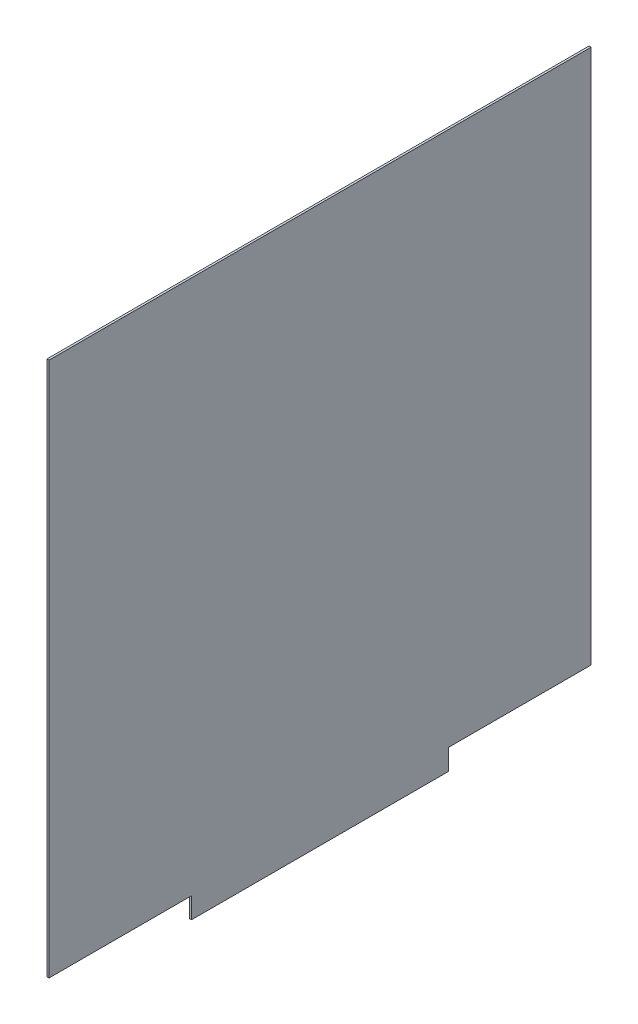
ISO-10303-21;
HEADER;
FILE_DESCRIPTION(('STEP AP214'),'2;1');
FILE_NAME('part.step','',(''),(''),'','','');
FILE_SCHEMA(('AUTOMOTIVE_DESIGN { 1 0 10303 214 1 1 1 1 }'));
ENDSEC;
DATA;
#1=APPLICATION_CONTEXT('core data for automotive mechanical design processes');
#2=APPLICATION_PROTOCOL_DEFINITION('international standard','automotive_design',2000,#1);
#3=PRODUCT_CONTEXT('',#1,'mechanical');
#4=PRODUCT('Part','Part','',(#3));
#5=PRODUCT_RELATED_PRODUCT_CATEGORY('part','',(#4));
#6=PRODUCT_DEFINITION_FORMATION('','',#4);
#7=PRODUCT_DEFINITION_CONTEXT('part definition',#1,'design');
#8=PRODUCT_DEFINITION('design','',#6,#7);
#9=PRODUCT_DEFINITION_SHAPE('','',#8);
#10=(LENGTH_UNIT() NAMED_UNIT(*) SI_UNIT(.MILLI.,.METRE.));
#11=(NAMED_UNIT(*) PLANE_ANGLE_UNIT() SI_UNIT($,.RADIAN.));
#12=(NAMED_UNIT(*) SI_UNIT($,.STERADIAN.) SOLID_ANGLE_UNIT());
#13=UNCERTAINTY_MEASURE_WITH_UNIT(LENGTH_MEASURE(1.E-05),#10,'distance_accuracy_value','');
#14=(GEOMETRIC_REPRESENTATION_CONTEXT(3) GLOBAL_UNCERTAINTY_ASSIGNED_CONTEXT((#13)) GLOBAL_UNIT_ASSIGNED_CONTEXT((#10,
#11,#12)) REPRESENTATION_CONTEXT('',''));
#15=CARTESIAN_POINT('',(0.,0.,0.));
#16=DIRECTION('',(0.,0.,1.));
#17=DIRECTION('',(1.,0.,0.));
#18=AXIS2_PLACEMENT_3D('',#15,#16,#17);
#19=CARTESIAN_POINT('',(678.,400.,-3.));
#20=DIRECTION('',(0.,0.,-1.));
#21=DIRECTION('',(0.,1.,0.));
#22=AXIS2_PLACEMENT_3D('',#19,#20,#21);
#23=PLANE('',#22);
#24=DIRECTION('',(0.,-1.,0.));
#25=VECTOR('',#24,1.);
#26=CARTESIAN_POINT('',(675.,400.,-3.));
#27=LINE('',#26,#25);
#28=CARTESIAN_POINT('',(675.,400.,-3.));
#29=VERTEX_POINT('',#28);
#30=CARTESIAN_POINT('',(675.,-370.,-3.));
#31=VERTEX_POINT('',#30);
#32=EDGE_CURVE('E194',#29,#31,#27,.T.);
#33=ORIENTED_EDGE('',*,*,#32,.T.);
#34=DIRECTION('',(-1.,0.,0.));
#35=VECTOR('',#34,1.);
#36=CARTESIAN_POINT('',(678.,-370.,-3.));
#37=LINE('',#36,#35);
#38=CARTESIAN_POINT('',(678.,-370.,-3.));
#39=VERTEX_POINT('',#38);
#40=EDGE_CURVE('E12',#39,#31,#37,.T.);
#41=ORIENTED_EDGE('',*,*,#40,.F.);
#42=DIRECTION('',(0.,-1.,0.));
#43=VECTOR('',#42,1.);
#44=CARTESIAN_POINT('',(678.,400.,-3.));
#45=LINE('',#44,#43);
#46=CARTESIAN_POINT('',(678.,400.,-3.));
#47=VERTEX_POINT('',#46);
#48=EDGE_CURVE('E159',#47,#39,#45,.T.);
#49=ORIENTED_EDGE('',*,*,#48,.F.);
#50=DIRECTION('',(-1.,0.,0.));
#51=VECTOR('',#50,1.);
#52=CARTESIAN_POINT('',(678.,400.,-3.));
#53=LINE('',#52,#51);
#54=EDGE_CURVE('E134',#47,#29,#53,.T.);
#55=ORIENTED_EDGE('',*,*,#54,.T.);
#56=EDGE_LOOP('',(#33,#41,#49,#55));
#57=FACE_BOUND('',#56,.T.);
#58=ADVANCED_FACE('F39',(#57),#23,.F.);
#59=CARTESIAN_POINT('',(678.,-370.,-3.));
#60=DIRECTION('',(0.,1.,0.));
#61=DIRECTION('',(0.,0.,1.));
#62=AXIS2_PLACEMENT_3D('',#59,#60,#61);
#63=PLANE('',#62);
#64=DIRECTION('',(0.,0.,-1.));
#65=VECTOR('',#64,1.);
#66=CARTESIAN_POINT('',(675.,-370.,-3.));
#67=LINE('',#66,#65);
#68=CARTESIAN_POINT('',(675.,-370.,-208.));
#69=VERTEX_POINT('',#68);
#70=EDGE_CURVE('E188',#31,#69,#67,.T.);
#71=ORIENTED_EDGE('',*,*,#70,.T.);
#72=DIRECTION('',(-1.,0.,0.));
#73=VECTOR('',#72,1.);
#74=CARTESIAN_POINT('',(678.,-370.,-208.));
#75=LINE('',#74,#73);
#76=CARTESIAN_POINT('',(678.,-370.,-208.));
#77=VERTEX_POINT('',#76);
#78=EDGE_CURVE('E47',#77,#69,#75,.T.);
#79=ORIENTED_EDGE('',*,*,#78,.F.);
#80=DIRECTION('',(0.,0.,-1.));
#81=VECTOR('',#80,1.);
#82=CARTESIAN_POINT('',(678.,-370.,-3.));
#83=LINE('',#82,#81);
#84=EDGE_CURVE('E98',#39,#77,#83,.T.);
#85=ORIENTED_EDGE('',*,*,#84,.F.);
#86=ORIENTED_EDGE('',*,*,#40,.T.);
#87=EDGE_LOOP('',(#71,#79,#85,#86));
#88=FACE_BOUND('',#87,.T.);
#89=ADVANCED_FACE('F213',(#88),#63,.F.);
#90=CARTESIAN_POINT('',(678.,-370.,-208.));
#91=DIRECTION('',(0.,0.,-1.));
#92=DIRECTION('',(-1.,0.,0.));
#93=AXIS2_PLACEMENT_3D('',#90,#91,#92);
#94=PLANE('',#93);
#95=DIRECTION('',(0.,-1.,0.));
#96=VECTOR('',#95,1.);
#97=CARTESIAN_POINT('',(675.,-370.,-208.));
#98=LINE('',#97,#96);
#99=CARTESIAN_POINT('',(675.,-400.,-208.));
#100=VERTEX_POINT('',#99);
#101=EDGE_CURVE('E183',#69,#100,#98,.T.);
#102=ORIENTED_EDGE('',*,*,#101,.T.);
#103=DIRECTION('',(-1.,0.,0.));
#104=VECTOR('',#103,1.);
#105=CARTESIAN_POINT('',(678.,-400.,-208.));
#106=LINE('',#105,#104);
#107=CARTESIAN_POINT('',(678.,-400.,-208.));
#108=VERTEX_POINT('',#107);
#109=EDGE_CURVE('E175',#108,#100,#106,.T.);
#110=ORIENTED_EDGE('',*,*,#109,.F.);
#111=DIRECTION('',(0.,-1.,0.));
#112=VECTOR('',#111,1.);
#113=CARTESIAN_POINT('',(678.,-370.,-208.));
#114=LINE('',#113,#112);
#115=EDGE_CURVE('E151',#77,#108,#114,.T.);
#116=ORIENTED_EDGE('',*,*,#115,.F.);
#117=ORIENTED_EDGE('',*,*,#78,.T.);
#118=EDGE_LOOP('',(#102,#110,#116,#117));
#119=FACE_BOUND('',#118,.T.);
#120=ADVANCED_FACE('F181',(#119),#94,.F.);
#121=CARTESIAN_POINT('',(678.,-400.,-208.));
#122=DIRECTION('',(0.,1.,0.));
#123=DIRECTION('',(0.,0.,1.));
#124=AXIS2_PLACEMENT_3D('',#121,#122,#123);
#125=PLANE('',#124);
#126=DIRECTION('',(0.,0.,-1.));
#127=VECTOR('',#126,1.);
#128=CARTESIAN_POINT('',(675.,-400.,-208.));
#129=LINE('',#128,#127);
#130=CARTESIAN_POINT('',(675.,-400.,-578.));
#131=VERTEX_POINT('',#130);
#132=EDGE_CURVE('E190',#100,#131,#129,.T.);
#133=ORIENTED_EDGE('',*,*,#132,.T.);
#134=DIRECTION('',(-1.,0.,0.));
#135=VECTOR('',#134,1.);
#136=CARTESIAN_POINT('',(678.,-400.,-578.));
#137=LINE('',#136,#135);
#138=CARTESIAN_POINT('',(678.,-400.,-578.));
#139=VERTEX_POINT('',#138);
#140=EDGE_CURVE('E172',#139,#131,#137,.T.);
#141=ORIENTED_EDGE('',*,*,#140,.F.);
#142=DIRECTION('',(0.,0.,-1.));
#143=VECTOR('',#142,1.);
#144=CARTESIAN_POINT('',(678.,-400.,-208.));
#145=LINE('',#144,#143);
#146=EDGE_CURVE('E147',#108,#139,#145,.T.);
#147=ORIENTED_EDGE('',*,*,#146,.F.);
#148=ORIENTED_EDGE('',*,*,#109,.T.);
#149=EDGE_LOOP('',(#133,#141,#147,#148));
#150=FACE_BOUND('',#149,.T.);
#151=ADVANCED_FACE('F220',(#150),#125,.F.);
#152=CARTESIAN_POINT('',(678.,-400.,-578.));
#153=DIRECTION('',(0.,0.,1.));
#154=DIRECTION('',(1.,0.,0.));
#155=AXIS2_PLACEMENT_3D('',#152,#153,#154);
#156=PLANE('',#155);
#157=DIRECTION('',(0.,1.,0.));
#158=VECTOR('',#157,1.);
#159=CARTESIAN_POINT('',(675.,-400.,-578.));
#160=LINE('',#159,#158);
#161=CARTESIAN_POINT('',(675.,-370.,-578.));
#162=VERTEX_POINT('',#161);
#163=EDGE_CURVE('E192',#131,#162,#160,.T.);
#164=ORIENTED_EDGE('',*,*,#163,.T.);
#165=DIRECTION('',(-1.,0.,0.));
#166=VECTOR('',#165,1.);
#167=CARTESIAN_POINT('',(678.,-370.,-578.));
#168=LINE('',#167,#166);
#169=CARTESIAN_POINT('',(678.,-370.,-578.));
#170=VERTEX_POINT('',#169);
#171=EDGE_CURVE('E127',#170,#162,#168,.T.);
#172=ORIENTED_EDGE('',*,*,#171,.F.);
#173=DIRECTION('',(0.,1.,0.));
#174=VECTOR('',#173,1.);
#175=CARTESIAN_POINT('',(678.,-400.,-578.));
#176=LINE('',#175,#174);
#177=EDGE_CURVE('E117',#139,#170,#176,.T.);
#178=ORIENTED_EDGE('',*,*,#177,.F.);
#179=ORIENTED_EDGE('',*,*,#140,.T.);
#180=EDGE_LOOP('',(#164,#172,#178,#179));
#181=FACE_BOUND('',#180,.T.);
#182=ADVANCED_FACE('F198',(#181),#156,.F.);
#183=CARTESIAN_POINT('',(678.,-370.,-578.));
#184=DIRECTION('',(0.,1.,0.));
#185=DIRECTION('',(0.,0.,1.));
#186=AXIS2_PLACEMENT_3D('',#183,#184,#185);
#187=PLANE('',#186);
#188=DIRECTION('',(0.,0.,-1.));
#189=VECTOR('',#188,1.);
#190=CARTESIAN_POINT('',(675.,-370.,-578.));
#191=LINE('',#190,#189);
#192=CARTESIAN_POINT('',(675.,-370.,-783.));
#193=VERTEX_POINT('',#192);
#194=EDGE_CURVE('E126',#162,#193,#191,.T.);
#195=ORIENTED_EDGE('',*,*,#194,.T.);
#196=DIRECTION('',(-1.,0.,0.));
#197=VECTOR('',#196,1.);
#198=CARTESIAN_POINT('',(678.,-370.,-783.));
#199=LINE('',#198,#197);
#200=CARTESIAN_POINT('',(678.,-370.,-783.));
#201=VERTEX_POINT('',#200);
#202=EDGE_CURVE('E123',#201,#193,#199,.T.);
#203=ORIENTED_EDGE('',*,*,#202,.F.);
#204=DIRECTION('',(0.,0.,-1.));
#205=VECTOR('',#204,1.);
#206=CARTESIAN_POINT('',(678.,-370.,-578.));
#207=LINE('',#206,#205);
#208=EDGE_CURVE('E111',#170,#201,#207,.T.);
#209=ORIENTED_EDGE('',*,*,#208,.F.);
#210=ORIENTED_EDGE('',*,*,#171,.T.);
#211=EDGE_LOOP('',(#195,#203,#209,#210));
#212=FACE_BOUND('',#211,.T.);
#213=ADVANCED_FACE('F124',(#212),#187,.F.);
#214=CARTESIAN_POINT('',(678.,400.,-783.));
#215=DIRECTION('',(0.,0.,1.));
#216=DIRECTION('',(0.,-1.,0.));
#217=AXIS2_PLACEMENT_3D('',#214,#215,#216);
#218=PLANE('',#217);
#219=DIRECTION('',(0.,1.,0.));
#220=VECTOR('',#219,1.);
#221=CARTESIAN_POINT('',(675.,400.,-783.));
#222=LINE('',#221,#220);
#223=CARTESIAN_POINT('',(675.,400.,-783.));
#224=VERTEX_POINT('',#223);
#225=EDGE_CURVE('E84',#193,#224,#222,.T.);
#226=ORIENTED_EDGE('',*,*,#225,.T.);
#227=DIRECTION('',(-1.,0.,0.));
#228=VECTOR('',#227,1.);
#229=CARTESIAN_POINT('',(678.,400.,-783.));
#230=LINE('',#229,#228);
#231=CARTESIAN_POINT('',(678.,400.,-783.));
#232=VERTEX_POINT('',#231);
#233=EDGE_CURVE('E128',#232,#224,#230,.T.);
#234=ORIENTED_EDGE('',*,*,#233,.F.);
#235=DIRECTION('',(0.,1.,0.));
#236=VECTOR('',#235,1.);
#237=CARTESIAN_POINT('',(678.,400.,-783.));
#238=LINE('',#237,#236);
#239=EDGE_CURVE('E115',#201,#232,#238,.T.);
#240=ORIENTED_EDGE('',*,*,#239,.F.);
#241=ORIENTED_EDGE('',*,*,#202,.T.);
#242=EDGE_LOOP('',(#226,#234,#240,#241));
#243=FACE_BOUND('',#242,.T.);
#244=ADVANCED_FACE('F130',(#243),#218,.F.);
#245=CARTESIAN_POINT('',(678.,400.,-3.));
#246=DIRECTION('',(0.,-1.,0.));
#247=DIRECTION('',(0.,0.,-1.));
#248=AXIS2_PLACEMENT_3D('',#245,#246,#247);
#249=PLANE('',#248);
#250=DIRECTION('',(0.,0.,1.));
#251=VECTOR('',#250,1.);
#252=CARTESIAN_POINT('',(675.,400.,-3.));
#253=LINE('',#252,#251);
#254=EDGE_CURVE('E90',#224,#29,#253,.T.);
#255=ORIENTED_EDGE('',*,*,#254,.T.);
#256=ORIENTED_EDGE('',*,*,#54,.F.);
#257=DIRECTION('',(0.,0.,1.));
#258=VECTOR('',#257,1.);
#259=CARTESIAN_POINT('',(678.,400.,-3.));
#260=LINE('',#259,#258);
#261=EDGE_CURVE('E55',#232,#47,#260,.T.);
#262=ORIENTED_EDGE('',*,*,#261,.F.);
#263=ORIENTED_EDGE('',*,*,#233,.T.);
#264=EDGE_LOOP('',(#255,#256,#262,#263));
#265=FACE_BOUND('',#264,.T.);
#266=ADVANCED_FACE('F202',(#265),#249,.F.);
#267=CARTESIAN_POINT('',(678.,0.,0.));
#268=DIRECTION('',(1.,0.,0.));
#269=DIRECTION('',(0.,0.,-1.));
#270=AXIS2_PLACEMENT_3D('',#267,#268,#269);
#271=PLANE('',#270);
#272=ORIENTED_EDGE('',*,*,#48,.T.);
#273=ORIENTED_EDGE('',*,*,#84,.T.);
#274=ORIENTED_EDGE('',*,*,#115,.T.);
#275=ORIENTED_EDGE('',*,*,#146,.T.);
#276=ORIENTED_EDGE('',*,*,#177,.T.);
#277=ORIENTED_EDGE('',*,*,#208,.T.);
#278=ORIENTED_EDGE('',*,*,#239,.T.);
#279=ORIENTED_EDGE('',*,*,#261,.T.);
#280=EDGE_LOOP('',(#272,#273,#274,#275,#276,#277,#278,#279));
#281=FACE_BOUND('',#280,.T.);
#282=ADVANCED_FACE('F113',(#281),#271,.T.);
#283=CARTESIAN_POINT('',(675.,0.,0.));
#284=DIRECTION('',(1.,0.,0.));
#285=DIRECTION('',(0.,0.,-1.));
#286=AXIS2_PLACEMENT_3D('',#283,#284,#285);
#287=PLANE('',#286);
#288=ORIENTED_EDGE('',*,*,#32,.F.);
#289=ORIENTED_EDGE('',*,*,#254,.F.);
#290=ORIENTED_EDGE('',*,*,#225,.F.);
#291=ORIENTED_EDGE('',*,*,#194,.F.);
#292=ORIENTED_EDGE('',*,*,#163,.F.);
#293=ORIENTED_EDGE('',*,*,#132,.F.);
#294=ORIENTED_EDGE('',*,*,#101,.F.);
#295=ORIENTED_EDGE('',*,*,#70,.F.);
#296=EDGE_LOOP('',(#288,#289,#290,#291,#292,#293,#294,#295));
#297=FACE_BOUND('',#296,.T.);
#298=ADVANCED_FACE('F187',(#297),#287,.F.);
#299=CLOSED_SHELL('',(#58,#89,#120,#151,#182,#213,#244,#266,#282,#298));
#300=MANIFOLD_SOLID_BREP('B2',#299);
#301=ADVANCED_BREP_SHAPE_REPRESENTATION('',(#18,#300),#14);
#302=SHAPE_DEFINITION_REPRESENTATION(#9,#301);
ENDSEC;
END-ISO-10303-21;
